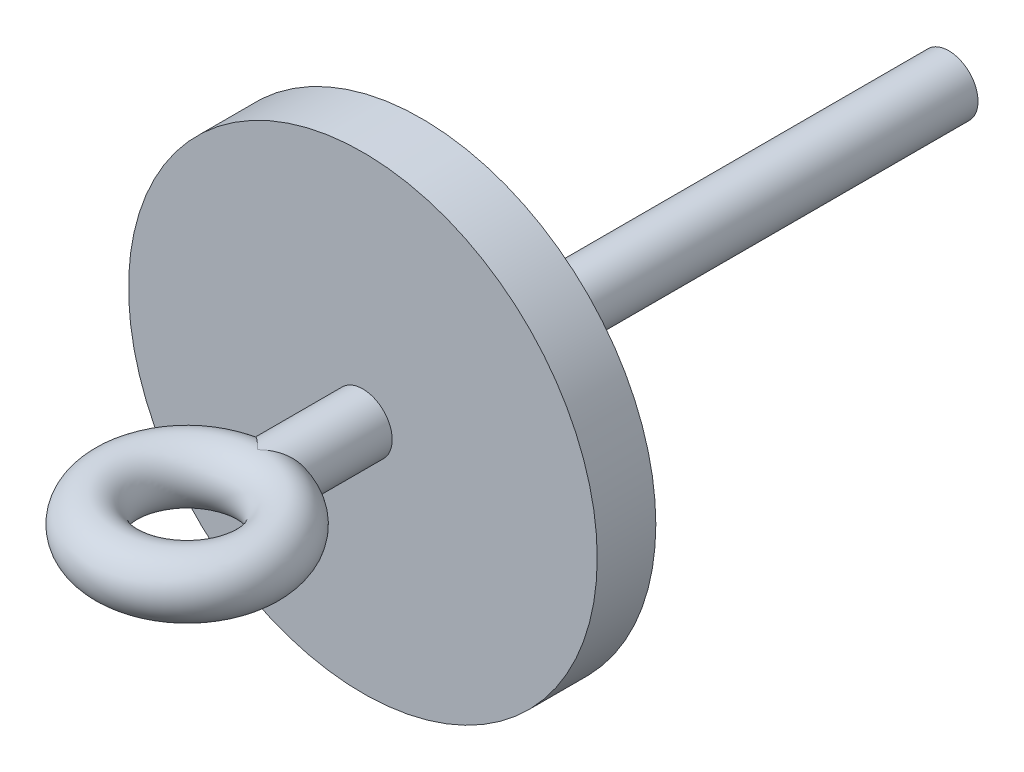
ISO-10303-21;
HEADER;
FILE_DESCRIPTION(('STEP AP214'),'2;1');
FILE_NAME('part.step','',(''),(''),'','','');
FILE_SCHEMA(('AUTOMOTIVE_DESIGN { 1 0 10303 214 1 1 1 1 }'));
ENDSEC;
DATA;
#1=APPLICATION_CONTEXT('core data for automotive mechanical design processes');
#2=APPLICATION_PROTOCOL_DEFINITION('international standard','automotive_design',2000,#1);
#3=PRODUCT_CONTEXT('',#1,'mechanical');
#4=PRODUCT('Part','Part','',(#3));
#5=PRODUCT_RELATED_PRODUCT_CATEGORY('part','',(#4));
#6=PRODUCT_DEFINITION_FORMATION('','',#4);
#7=PRODUCT_DEFINITION_CONTEXT('part definition',#1,'design');
#8=PRODUCT_DEFINITION('design','',#6,#7);
#9=PRODUCT_DEFINITION_SHAPE('','',#8);
#10=(LENGTH_UNIT() NAMED_UNIT(*) SI_UNIT(.MILLI.,.METRE.));
#11=(NAMED_UNIT(*) PLANE_ANGLE_UNIT() SI_UNIT($,.RADIAN.));
#12=(NAMED_UNIT(*) SI_UNIT($,.STERADIAN.) SOLID_ANGLE_UNIT());
#13=UNCERTAINTY_MEASURE_WITH_UNIT(LENGTH_MEASURE(1.E-05),#10,'distance_accuracy_value','');
#14=(GEOMETRIC_REPRESENTATION_CONTEXT(3) GLOBAL_UNCERTAINTY_ASSIGNED_CONTEXT((#13)) GLOBAL_UNIT_ASSIGNED_CONTEXT((#10,
#11,#12)) REPRESENTATION_CONTEXT('',''));
#15=CARTESIAN_POINT('',(0.,0.,0.));
#16=DIRECTION('',(0.,0.,1.));
#17=DIRECTION('',(1.,0.,0.));
#18=AXIS2_PLACEMENT_3D('',#15,#16,#17);
#19=CARTESIAN_POINT('',(0.,0.,35.56));
#20=DIRECTION('',(0.,0.,-1.));
#21=DIRECTION('',(-1.,0.,0.));
#22=AXIS2_PLACEMENT_3D('',#19,#20,#21);
#23=CYLINDRICAL_SURFACE('',#22,6.35);
#24=CARTESIAN_POINT('',(0.,-6.35000000000009,35.501253625829));
#25=CARTESIAN_POINT('',(-0.0037564512980739,-6.35000000036058,35.5050100734347));
#26=CARTESIAN_POINT('',(-0.00751223654004223,-6.34999666707801,35.508767242311));
#27=CARTESIAN_POINT('',(-0.271129257348103,-6.34952888217673,35.7725788813664));
#28=CARTESIAN_POINT('',(-0.527781565521979,-6.33312004361222,36.0360730521542));
#29=CARTESIAN_POINT('',(-1.03220959376142,-6.27070587561029,36.5683595895022));
#30=CARTESIAN_POINT('',(-1.27997450602316,-6.22466571976881,36.8371578292389));
#31=CARTESIAN_POINT('',(-1.76805434665272,-6.10414333444453,37.3825117283635));
#32=CARTESIAN_POINT('',(-2.00820748375621,-6.0292552810125,37.6591233476966));
#33=CARTESIAN_POINT('',(-2.35839961800037,-5.89711720426587,38.0756221022346));
#34=CARTESIAN_POINT('',(-2.47337437854273,-5.84981334488968,38.2146130487953));
#35=CARTESIAN_POINT('',(-2.69988551884257,-5.74878062329021,38.4930387674879));
#36=CARTESIAN_POINT('',(-2.81142221151381,-5.69505234796607,38.6324734979469));
#37=CARTESIAN_POINT('',(-2.92116985253,-5.63819711367648,38.7720672082961));
#38=B_SPLINE_CURVE_WITH_KNOTS('',3,(#24,#25,#26,#27,#28,#29,#30,#31,#32,#33,#34,#35,#36,#37),
.UNSPECIFIED.,.F.,.F.,(4,2,2,2,2,2,4),(0.,0.0159373808559223,1.11883785891247,2.22303697567802,
3.34337303091101,3.90269717381842,4.46197025894496),.UNSPECIFIED.);
#39=CARTESIAN_POINT('',(0.,-6.35,35.501253625829));
#40=VERTEX_POINT('',#39);
#41=CARTESIAN_POINT('',(-0.0586335826911054,-6.34972929367708,35.56));
#42=VERTEX_POINT('',#41);
#43=EDGE_CURVE('E77',#40,#42,#38,.T.);
#44=ORIENTED_EDGE('',*,*,#43,.F.);
#45=CARTESIAN_POINT('',(0.,-6.35000000000009,35.501253625829));
#46=CARTESIAN_POINT('',(0.0037564512980739,-6.35000000036058,35.5050100734347));
#47=CARTESIAN_POINT('',(0.00751223654004223,-6.34999666707801,35.508767242311));
#48=CARTESIAN_POINT('',(0.271129257348103,-6.34952888217673,35.7725788813664));
#49=CARTESIAN_POINT('',(0.527781565521979,-6.33312004361222,36.0360730521542));
#50=CARTESIAN_POINT('',(1.03220959376142,-6.27070587561029,36.5683595895022));
#51=CARTESIAN_POINT('',(1.27997450602316,-6.22466571976881,36.8371578292389));
#52=CARTESIAN_POINT('',(1.76805434665272,-6.10414333444453,37.3825117283635));
#53=CARTESIAN_POINT('',(2.00820748375621,-6.0292552810125,37.6591233476966));
#54=CARTESIAN_POINT('',(2.35839961800037,-5.89711720426587,38.0756221022346));
#55=CARTESIAN_POINT('',(2.47337437854273,-5.84981334488968,38.2146130487953));
#56=CARTESIAN_POINT('',(2.69988551884257,-5.74878062329021,38.4930387674879));
#57=CARTESIAN_POINT('',(2.81142221151381,-5.69505234796607,38.6324734979469));
#58=CARTESIAN_POINT('',(2.92116985253,-5.63819711367648,38.7720672082961));
#59=B_SPLINE_CURVE_WITH_KNOTS('',3,(#45,#46,#47,#48,#49,#50,#51,#52,#53,#54,#55,#56,#57,#58),
.UNSPECIFIED.,.F.,.F.,(4,2,2,2,2,2,4),(0.,0.0159373808559223,1.11883785891247,2.22303697567802,
3.34337303091101,3.90269717381842,4.46197025894496),.UNSPECIFIED.);
#60=CARTESIAN_POINT('',(0.0586335826906821,-6.34972929367708,35.56));
#61=VERTEX_POINT('',#60);
#62=EDGE_CURVE('E85',#61,#40,#59,.F.);
#63=ORIENTED_EDGE('',*,*,#62,.F.);
#64=CARTESIAN_POINT('',(0.,0.,35.56));
#65=DIRECTION('',(0.,0.,-1.));
#66=DIRECTION('',(-1.,0.,0.));
#67=AXIS2_PLACEMENT_3D('',#64,#65,#66);
#68=CIRCLE('',#67,6.35);
#69=EDGE_CURVE('E87',#61,#42,#68,.T.);
#70=ORIENTED_EDGE('',*,*,#69,.T.);
#71=EDGE_LOOP('',(#44,#63,#70));
#72=FACE_BOUND('',#71,.T.);
#73=ADVANCED_FACE('F34',(#72),#23,.T.);
#74=CARTESIAN_POINT('',(0.,6.35000000000009,35.501253625829));
#75=CARTESIAN_POINT('',(-0.00375639361291877,6.35000000520154,35.4974972215348));
#76=CARTESIAN_POINT('',(-0.00751356298510425,6.34999667190639,35.4937414358622));
#77=CARTESIAN_POINT('',(-0.390107309279998,6.34931703307963,35.1114303247573));
#78=CARTESIAN_POINT('',(-0.776767068298366,6.31467777937883,34.7392009537541));
#79=CARTESIAN_POINT('',(-1.3599412594465,6.2058328971805,34.1959170797559));
#80=CARTESIAN_POINT('',(-1.5551065347651,6.15997829409396,34.0171209188299));
#81=CARTESIAN_POINT('',(-1.94504898525613,6.04817108858059,33.6653536879688));
#82=CARTESIAN_POINT('',(-2.13982621408808,5.98222149186214,33.4923817511693));
#83=CARTESIAN_POINT('',(-2.4985011900884,5.84050488544785,33.1784104739015));
#84=CARTESIAN_POINT('',(-2.66271267322511,5.76762446414559,33.0364608093109));
#85=CARTESIAN_POINT('',(-2.98815377597978,5.60592855938799,32.7583544698739));
#86=CARTESIAN_POINT('',(-3.14938402460134,5.51711648062751,32.6221965649684));
#87=CARTESIAN_POINT('',(-3.4671726865702,5.32314077379262,32.3566803708456));
#88=CARTESIAN_POINT('',(-3.62373661829684,5.21799745430634,32.2273138999786));
#89=CARTESIAN_POINT('',(-3.93064752326748,4.99088496493317,31.9762024355633));
#90=CARTESIAN_POINT('',(-4.08099595734759,4.86891977826944,31.8544556476546));
#91=CARTESIAN_POINT('',(-4.34550443228042,4.63294828697975,31.642176622167));
#92=CARTESIAN_POINT('',(-4.46108235878655,4.52188801476302,31.5501305011624));
#93=CARTESIAN_POINT('',(-4.68573153522437,4.28866222868916,31.3724121616421));
#94=CARTESIAN_POINT('',(-4.79480418688662,4.16649912164926,31.2867385690092));
#95=CARTESIAN_POINT('',(-5.00526014226069,3.91117004389601,31.1224288672806));
#96=CARTESIAN_POINT('',(-5.10664036240707,3.77799970508135,31.0437955780907));
#97=CARTESIAN_POINT('',(-5.30029598327434,3.50112633498064,30.8943980935939));
#98=CARTESIAN_POINT('',(-5.39257555120921,3.35742817744298,30.8236302947541));
#99=CARTESIAN_POINT('',(-5.56754696086991,3.05862334535851,30.6900740282723));
#100=CARTESIAN_POINT('',(-5.65013865112166,2.90342069343537,30.6273683593042));
#101=CARTESIAN_POINT('',(-5.80324783550511,2.58383162487627,30.5115839228614));
#102=CARTESIAN_POINT('',(-5.87377192293083,2.41945028867314,30.4584998975292));
#103=CARTESIAN_POINT('',(-6.0014190404324,2.08275357144328,30.3627225183438));
#104=CARTESIAN_POINT('',(-6.05855021794399,1.91044309075926,30.3200228466837));
#105=CARTESIAN_POINT('',(-6.15826208039579,1.55935478160778,30.2456718234663));
#106=CARTESIAN_POINT('',(-6.20084576919992,1.38057829672605,30.2140181910189));
#107=CARTESIAN_POINT('',(-6.26523841865324,1.04584279074085,30.1662241647043));
#108=CARTESIAN_POINT('',(-6.28921686049892,0.890528261850745,30.14846041242));
#109=CARTESIAN_POINT('',(-6.32561388032198,0.577819579396626,30.1215148268776));
#110=CARTESIAN_POINT('',(-6.33803386354341,0.420425680996726,30.112331950381));
#111=CARTESIAN_POINT('',(-6.35109429752573,0.104956574372978,30.1026758873965));
#112=CARTESIAN_POINT('',(-6.35174007531249,-0.0531182933776525,30.1021987621491));
#113=CARTESIAN_POINT('',(-6.34125416587055,-0.368660313923154,30.1099508347809));
#114=CARTESIAN_POINT('',(-6.33012290220735,-0.52612748836951,30.1181797195453));
#115=CARTESIAN_POINT('',(-6.29773870122358,-0.825646545629134,30.1421496014706));
#116=CARTESIAN_POINT('',(-6.27743832295677,-0.967859740884441,30.1571838679943));
#117=CARTESIAN_POINT('',(-6.22745021484477,-1.24974316726769,30.1942642156613));
#118=CARTESIAN_POINT('',(-6.19775957077497,-1.38941259469895,30.216312473576));
#119=CARTESIAN_POINT('',(-6.12941514687342,-1.66521724938565,30.2671721018601));
#120=CARTESIAN_POINT('',(-6.09076482713282,-1.80135381846764,30.2959808614787));
#121=CARTESIAN_POINT('',(-6.00498571721766,-2.06941080556968,30.3600837925023));
#122=CARTESIAN_POINT('',(-5.95785370639359,-2.2013295995386,30.3953804275788));
#123=CARTESIAN_POINT('',(-5.85394359350793,-2.4646608432169,30.4734358359549));
#124=CARTESIAN_POINT('',(-5.79689050614631,-2.59590135702645,30.5164087001671));
#125=CARTESIAN_POINT('',(-5.67502757058692,-2.85250168055658,30.6085320310492));
#126=CARTESIAN_POINT('',(-5.6102149340774,-2.97785935368103,30.6576847186932));
#127=CARTESIAN_POINT('',(-5.4052292509548,-3.34427909330362,30.8137817328697));
#128=CARTESIAN_POINT('',(-5.25444328416657,-3.57585001659852,30.929413647487));
#129=CARTESIAN_POINT('',(-4.90991290770657,-4.03841874131397,31.1963613285227));
#130=CARTESIAN_POINT('',(-4.71314274171591,-4.26558204133736,31.3503467276975));
#131=CARTESIAN_POINT('',(-4.29872200940565,-4.68295380439284,31.6791010956807));
#132=CARTESIAN_POINT('',(-4.08105477197854,-4.87313238990884,31.8538866853871));
#133=CARTESIAN_POINT('',(-3.69032891616548,-5.17181733053833,32.1724717346972));
#134=CARTESIAN_POINT('',(-3.52044516507567,-5.28868752811816,32.3124607297584));
#135=CARTESIAN_POINT('',(-3.17517117605227,-5.50291670054365,32.6004201763046));
#136=CARTESIAN_POINT('',(-2.99977873715972,-5.60026775893275,32.748393835408));
#137=CARTESIAN_POINT('',(-2.46804040076927,-5.86411467374307,33.2028719306896));
#138=CARTESIAN_POINT('',(-2.10625559426743,-6.00231400935948,33.5198346776668));
#139=CARTESIAN_POINT('',(-1.45261018380176,-6.18906686582442,34.1096606501983));
#140=CARTESIAN_POINT('',(-1.16087377709956,-6.24984757095819,34.3790679257008));
#141=CARTESIAN_POINT('',(-0.58179700658449,-6.33002123891588,34.9277551390341));
#142=CARTESIAN_POINT('',(-0.294449784109341,-6.3494871653946,35.2070167851061));
#143=CARTESIAN_POINT('',(-0.00751359891461443,-6.3499966691027,35.493741405258));
#144=CARTESIAN_POINT('',(-0.00375642976168776,-6.35000000240225,35.4974971907567));
#145=CARTESIAN_POINT('',(0.,-6.35000000000009,35.501253625829));
#146=B_SPLINE_CURVE_WITH_KNOTS('',3,(#74,#75,#76,#77,#78,#79,#80,#81,#82,#83,#84,#85,#86,#87,
#88,#89,#90,#91,#92,#93,#94,#95,#96,#97,#98,#99,#100,#101,#102,#103,#104,#105,#106,#107,#108,
#109,#110,#111,#112,#113,#114,#115,#116,#117,#118,#119,#120,#121,#122,#123,#124,#125,#126,#127,
#128,#129,#130,#131,#132,#133,#134,#135,#136,#137,#138,#139,#140,#141,#142,#143,#144,#145),
.UNSPECIFIED.,.F.,.F.,(4,2,2,2,2,2,2,2,2,2,2,2,2,2,2,2,2,2,2,2,2,2,2,2,2,2,2,2,2,2,2,2,2,2,2,4),
(0.,0.0159373808601486,1.62257605524638,2.42788792124242,3.23307939180828,3.91940326281971,
4.60558063648164,5.29091145206725,5.9760802669741,6.53008486902063,7.08396966185482,
7.63807532303239,8.19192606799116,8.75107450688236,9.30991646537213,9.86841757086282,
10.4268032834616,10.9006289197143,11.3743969420844,11.847950611377,12.3214872497212,
12.7543088532636,13.1872649129708,13.6200540493278,14.0530078715458,14.5007833109723,
14.948720139442,15.8440552615959,16.8534998557398,17.863756556851,18.6104826085817,
19.3575109031355,20.8521042157741,22.0551983034912,23.2561659018778,23.2721032827379),.UNSPECIFIED.);
#147=CARTESIAN_POINT('',(0.,6.35,35.501253625829));
#148=VERTEX_POINT('',#147);
#149=EDGE_CURVE('E74',#148,#40,#146,.T.);
#150=ORIENTED_EDGE('',*,*,#149,.F.);
#151=CARTESIAN_POINT('',(0.,-6.35000000000009,35.501253625829));
#152=CARTESIAN_POINT('',(0.00375639361291877,-6.35000000520154,35.4974972215348));
#153=CARTESIAN_POINT('',(0.00751356298510425,-6.34999667190639,35.4937414358622));
#154=CARTESIAN_POINT('',(0.390107309279998,-6.34931703307963,35.1114303247573));
#155=CARTESIAN_POINT('',(0.776767068298366,-6.31467777937883,34.7392009537541));
#156=CARTESIAN_POINT('',(1.3599412594465,-6.2058328971805,34.1959170797559));
#157=CARTESIAN_POINT('',(1.5551065347651,-6.15997829409396,34.0171209188299));
#158=CARTESIAN_POINT('',(1.94504898525613,-6.04817108858059,33.6653536879688));
#159=CARTESIAN_POINT('',(2.13982621408808,-5.98222149186214,33.4923817511693));
#160=CARTESIAN_POINT('',(2.4985011900884,-5.84050488544785,33.1784104739015));
#161=CARTESIAN_POINT('',(2.66271267322511,-5.76762446414559,33.0364608093109));
#162=CARTESIAN_POINT('',(2.98815377597978,-5.60592855938799,32.7583544698739));
#163=CARTESIAN_POINT('',(3.14938402460134,-5.51711648062751,32.6221965649684));
#164=CARTESIAN_POINT('',(3.4671726865702,-5.32314077379262,32.3566803708456));
#165=CARTESIAN_POINT('',(3.62373661829684,-5.21799745430634,32.2273138999786));
#166=CARTESIAN_POINT('',(3.93064752326748,-4.99088496493317,31.9762024355633));
#167=CARTESIAN_POINT('',(4.08099595734759,-4.86891977826944,31.8544556476546));
#168=CARTESIAN_POINT('',(4.34550443228042,-4.63294828697975,31.642176622167));
#169=CARTESIAN_POINT('',(4.46108235878655,-4.52188801476302,31.5501305011624));
#170=CARTESIAN_POINT('',(4.68573153522437,-4.28866222868916,31.3724121616421));
#171=CARTESIAN_POINT('',(4.79480418688662,-4.16649912164926,31.2867385690092));
#172=CARTESIAN_POINT('',(5.00526014226069,-3.91117004389601,31.1224288672806));
#173=CARTESIAN_POINT('',(5.10664036240707,-3.77799970508135,31.0437955780907));
#174=CARTESIAN_POINT('',(5.30029598327434,-3.50112633498064,30.8943980935939));
#175=CARTESIAN_POINT('',(5.39257555120921,-3.35742817744298,30.8236302947541));
#176=CARTESIAN_POINT('',(5.56754696086991,-3.05862334535851,30.6900740282723));
#177=CARTESIAN_POINT('',(5.65013865112166,-2.90342069343537,30.6273683593042));
#178=CARTESIAN_POINT('',(5.80324783550511,-2.58383162487627,30.5115839228614));
#179=CARTESIAN_POINT('',(5.87377192293083,-2.41945028867314,30.4584998975292));
#180=CARTESIAN_POINT('',(6.0014190404324,-2.08275357144328,30.3627225183438));
#181=CARTESIAN_POINT('',(6.05855021794399,-1.91044309075926,30.3200228466837));
#182=CARTESIAN_POINT('',(6.15826208039579,-1.55935478160778,30.2456718234663));
#183=CARTESIAN_POINT('',(6.20084576919992,-1.38057829672605,30.2140181910189));
#184=CARTESIAN_POINT('',(6.26523841865324,-1.04584279074085,30.1662241647043));
#185=CARTESIAN_POINT('',(6.28921686049892,-0.890528261850745,30.14846041242));
#186=CARTESIAN_POINT('',(6.32561388032198,-0.577819579396626,30.1215148268776));
#187=CARTESIAN_POINT('',(6.33803386354341,-0.420425680996726,30.112331950381));
#188=CARTESIAN_POINT('',(6.35109429752573,-0.104956574372978,30.1026758873965));
#189=CARTESIAN_POINT('',(6.35174007531249,0.0531182933776525,30.1021987621491));
#190=CARTESIAN_POINT('',(6.34125416587055,0.368660313923154,30.1099508347809));
#191=CARTESIAN_POINT('',(6.33012290220735,0.52612748836951,30.1181797195453));
#192=CARTESIAN_POINT('',(6.29773870122358,0.825646545629134,30.1421496014706));
#193=CARTESIAN_POINT('',(6.27743832295677,0.967859740884441,30.1571838679943));
#194=CARTESIAN_POINT('',(6.22745021484477,1.24974316726769,30.1942642156613));
#195=CARTESIAN_POINT('',(6.19775957077497,1.38941259469895,30.216312473576));
#196=CARTESIAN_POINT('',(6.12941514687342,1.66521724938565,30.2671721018601));
#197=CARTESIAN_POINT('',(6.09076482713282,1.80135381846764,30.2959808614787));
#198=CARTESIAN_POINT('',(6.00498571721766,2.06941080556968,30.3600837925023));
#199=CARTESIAN_POINT('',(5.95785370639359,2.2013295995386,30.3953804275788));
#200=CARTESIAN_POINT('',(5.85394359350793,2.4646608432169,30.4734358359549));
#201=CARTESIAN_POINT('',(5.79689050614631,2.59590135702645,30.5164087001671));
#202=CARTESIAN_POINT('',(5.67502757058692,2.85250168055658,30.6085320310492));
#203=CARTESIAN_POINT('',(5.6102149340774,2.97785935368103,30.6576847186932));
#204=CARTESIAN_POINT('',(5.4052292509548,3.34427909330362,30.8137817328697));
#205=CARTESIAN_POINT('',(5.25444328416657,3.57585001659852,30.929413647487));
#206=CARTESIAN_POINT('',(4.90991290770657,4.03841874131397,31.1963613285227));
#207=CARTESIAN_POINT('',(4.71314274171591,4.26558204133736,31.3503467276975));
#208=CARTESIAN_POINT('',(4.29872200940565,4.68295380439284,31.6791010956807));
#209=CARTESIAN_POINT('',(4.08105477197854,4.87313238990884,31.8538866853871));
#210=CARTESIAN_POINT('',(3.69032891616548,5.17181733053833,32.1724717346972));
#211=CARTESIAN_POINT('',(3.52044516507567,5.28868752811816,32.3124607297584));
#212=CARTESIAN_POINT('',(3.17517117605227,5.50291670054365,32.6004201763046));
#213=CARTESIAN_POINT('',(2.99977873715972,5.60026775893275,32.748393835408));
#214=CARTESIAN_POINT('',(2.46804040076927,5.86411467374307,33.2028719306896));
#215=CARTESIAN_POINT('',(2.10625559426743,6.00231400935948,33.5198346776668));
#216=CARTESIAN_POINT('',(1.45261018380176,6.18906686582442,34.1096606501983));
#217=CARTESIAN_POINT('',(1.16087377709956,6.24984757095819,34.3790679257008));
#218=CARTESIAN_POINT('',(0.58179700658449,6.33002123891588,34.9277551390341));
#219=CARTESIAN_POINT('',(0.294449784109341,6.3494871653946,35.2070167851061));
#220=CARTESIAN_POINT('',(0.00751359891461443,6.3499966691027,35.493741405258));
#221=CARTESIAN_POINT('',(0.00375642976168776,6.35000000240225,35.4974971907567));
#222=CARTESIAN_POINT('',(0.,6.35000000000009,35.501253625829));
#223=B_SPLINE_CURVE_WITH_KNOTS('',3,(#151,#152,#153,#154,#155,#156,#157,#158,#159,#160,#161,
#162,#163,#164,#165,#166,#167,#168,#169,#170,#171,#172,#173,#174,#175,#176,#177,#178,#179,#180,
#181,#182,#183,#184,#185,#186,#187,#188,#189,#190,#191,#192,#193,#194,#195,#196,#197,#198,#199,
#200,#201,#202,#203,#204,#205,#206,#207,#208,#209,#210,#211,#212,#213,#214,#215,#216,#217,#218,
#219,#220,#221,#222),.UNSPECIFIED.,.F.,.F.,(4,2,2,2,2,2,2,2,2,2,2,2,2,2,2,2,2,2,2,2,2,2,2,2,2,2,
2,2,2,2,2,2,2,2,2,4),(0.,0.0159373808601486,1.62257605524638,2.42788792124242,3.23307939180828,
3.91940326281971,4.60558063648164,5.29091145206725,5.9760802669741,6.53008486902063,
7.08396966185482,7.63807532303239,8.19192606799116,8.75107450688236,9.30991646537213,
9.86841757086282,10.4268032834616,10.9006289197143,11.3743969420844,11.847950611377,
12.3214872497212,12.7543088532636,13.1872649129708,13.6200540493278,14.0530078715458,
14.5007833109723,14.948720139442,15.8440552615959,16.8534998557398,17.863756556851,
18.6104826085817,19.3575109031355,20.8521042157741,22.0551983034912,23.2561659018778,
23.2721032827379),.UNSPECIFIED.);
#224=EDGE_CURVE('E89',#40,#148,#223,.T.);
#225=ORIENTED_EDGE('',*,*,#224,.F.);
#226=EDGE_LOOP('',(#150,#225));
#227=FACE_BOUND('',#226,.T.);
#228=CARTESIAN_POINT('',(0.,0.,12.7));
#229=DIRECTION('',(0.,0.,1.));
#230=DIRECTION('',(1.,0.,0.));
#231=AXIS2_PLACEMENT_3D('',#228,#229,#230);
#232=CIRCLE('',#231,6.35);
#233=CARTESIAN_POINT('',(6.35,0.,12.7));
#234=VERTEX_POINT('',#233);
#235=EDGE_CURVE('E162',#234,#234,#232,.T.);
#236=ORIENTED_EDGE('',*,*,#235,.T.);
#237=EDGE_LOOP('',(#236));
#238=FACE_BOUND('',#237,.T.);
#239=ADVANCED_FACE('F91',(#227,#238),#23,.T.);
#240=CARTESIAN_POINT('',(0.,0.,35.56));
#241=DIRECTION('',(0.,0.,-1.));
#242=DIRECTION('',(-1.,0.,0.));
#243=AXIS2_PLACEMENT_3D('',#240,#241,#242);
#244=PLANE('',#243);
#245=CARTESIAN_POINT('',(-14.1992316571237,3.11948990475159,35.56));
#246=CARTESIAN_POINT('',(-14.0681365765391,3.27793501526219,35.56));
#247=CARTESIAN_POINT('',(-13.9286455019853,3.42942764303941,35.56));
#248=CARTESIAN_POINT('',(-13.6355341905472,3.71818828946817,35.56));
#249=CARTESIAN_POINT('',(-13.4819034529782,3.85544557284839,35.56));
#250=CARTESIAN_POINT('',(-13.1626777704734,4.11603913724592,35.56));
#251=CARTESIAN_POINT('',(-12.9970542351758,4.23934022718965,35.56));
#252=CARTESIAN_POINT('',(-12.6563219360084,4.47209705397215,35.56));
#253=CARTESIAN_POINT('',(-12.4812095636351,4.58154747001896,35.56));
#254=CARTESIAN_POINT('',(-12.0545007276696,4.82683875196605,35.56));
#255=CARTESIAN_POINT('',(-11.7994147076043,4.95661587218982,35.56));
#256=CARTESIAN_POINT('',(-11.2787063161964,5.19303594985384,35.56));
#257=CARTESIAN_POINT('',(-11.0130774930413,5.29966447472431,35.56));
#258=CARTESIAN_POINT('',(-10.4740292516195,5.49235423967037,35.56));
#259=CARTESIAN_POINT('',(-10.2005974272737,5.57838042063449,35.56));
#260=CARTESIAN_POINT('',(-9.64891231492096,5.73212058653271,35.56));
#261=CARTESIAN_POINT('',(-9.37066239072188,5.79984683949048,35.56));
#262=CARTESIAN_POINT('',(-8.61433001901108,5.96163800273751,35.56));
#263=CARTESIAN_POINT('',(-8.13307651465053,6.04082095359623,35.56));
#264=CARTESIAN_POINT('',(-7.16610664219062,6.16545253739759,35.56));
#265=CARTESIAN_POINT('',(-6.68038629701272,6.21086740071027,35.56));
#266=CARTESIAN_POINT('',(-5.70556590755282,6.2785764172918,35.56));
#267=CARTESIAN_POINT('',(-5.21646006431048,6.30078005613277,35.56));
#268=CARTESIAN_POINT('',(-4.48262879047559,6.32339990075735,35.56));
#269=CARTESIAN_POINT('',(-4.23802760858134,6.32915884822764,35.56));
#270=CARTESIAN_POINT('',(-3.74877673268384,6.3380857686028,35.56));
#271=CARTESIAN_POINT('',(-3.50412703896901,6.34125375647569,35.56));
#272=CARTESIAN_POINT('',(-3.0133066172643,6.34588009063594,35.56));
#273=CARTESIAN_POINT('',(-2.76713581005504,6.34732777716004,35.56));
#274=CARTESIAN_POINT('',(-2.27479089459125,6.34920586109839,35.56));
#275=CARTESIAN_POINT('',(-2.02861678633845,6.34963625902804,35.56));
#276=CARTESIAN_POINT('',(-1.536259901933,6.35004292727922,35.56));
#277=CARTESIAN_POINT('',(-1.2900771257811,6.35001918157072,35.56));
#278=CARTESIAN_POINT('',(-0.797711920403267,6.349897247307,35.56));
#279=CARTESIAN_POINT('',(-0.551529491177317,6.34979905885373,35.56));
#280=CARTESIAN_POINT('',(-0.0596328747198961,6.34971264937751,35.56));
#281=CARTESIAN_POINT('',(0.186081312465314,6.34972421953955,35.56));
#282=CARTESIAN_POINT('',(0.677510010683249,6.34983955634036,35.56));
#283=CARTESIAN_POINT('',(0.923224521715926,6.34994332311297,35.56));
#284=CARTESIAN_POINT('',(1.41465088517471,6.3500258890747,35.56));
#285=CARTESIAN_POINT('',(1.66036273760024,6.35000468964254,35.56));
#286=CARTESIAN_POINT('',(2.15178562076105,6.34942859705037,35.56));
#287=CARTESIAN_POINT('',(2.39749665149687,6.34887370520193,35.56));
#288=CARTESIAN_POINT('',(2.85134526337037,6.34681059832293,35.56));
#289=CARTESIAN_POINT('',(3.05948345092324,6.34546112011608,35.56));
#290=CARTESIAN_POINT('',(3.47574789106985,6.34150431291261,35.56));
#291=CARTESIAN_POINT('',(3.68387414370224,6.33889698824936,35.56));
#292=CARTESIAN_POINT('',(4.10018068788496,6.33189957597568,35.56));
#293=CARTESIAN_POINT('',(4.30836096868586,6.32750879072042,35.56));
#294=CARTESIAN_POINT('',(4.72466055811453,6.31634779689845,35.56));
#295=CARTESIAN_POINT('',(4.93277986556879,6.30957754520618,35.56));
#296=CARTESIAN_POINT('',(5.55644682046397,6.28475228305205,35.56));
#297=CARTESIAN_POINT('',(5.9718379472561,6.26217702174318,35.56));
#298=CARTESIAN_POINT('',(6.80125984287806,6.19912769623004,35.56));
#299=CARTESIAN_POINT('',(7.21529092086682,6.15865803105502,35.56));
#300=CARTESIAN_POINT('',(7.96950242551946,6.0622591140621,35.56));
#301=CARTESIAN_POINT('',(8.31016110947234,6.01017559076111,35.56));
#302=CARTESIAN_POINT('',(8.98758988539727,5.88512534667819,35.56));
#303=CARTESIAN_POINT('',(9.32436136126035,5.81216631234497,35.56));
#304=CARTESIAN_POINT('',(9.99101495422766,5.64118476020339,35.56));
#305=CARTESIAN_POINT('',(10.3209076813324,5.54320449511565,35.56));
#306=CARTESIAN_POINT('',(10.9703327361502,5.31780365178138,35.56));
#307=CARTESIAN_POINT('',(11.2898733111694,5.19040720089277,35.56));
#308=CARTESIAN_POINT('',(11.9473782852239,4.88615882438984,35.56));
#309=CARTESIAN_POINT('',(12.2835966031719,4.70544788123638,35.56));
#310=CARTESIAN_POINT('',(12.9267404678049,4.29758176356681,35.56));
#311=CARTESIAN_POINT('',(13.2336928429774,4.07046973779006,35.56));
#312=CARTESIAN_POINT('',(13.7596634891047,3.60668493048318,35.56));
#313=CARTESIAN_POINT('',(13.9849123758527,3.37719428819024,35.56));
#314=CARTESIAN_POINT('',(14.292159033369,3.00779483056579,35.56));
#315=CARTESIAN_POINT('',(14.3894700981202,2.88046783453529,35.56));
#316=CARTESIAN_POINT('',(14.5726204892649,2.61777495541423,35.56));
#317=CARTESIAN_POINT('',(14.6584616506589,2.48241036322723,35.56));
#318=CARTESIAN_POINT('',(14.8047249224587,2.22634305053424,35.56));
#319=CARTESIAN_POINT('',(14.8670200509174,2.10670713972802,35.56));
#320=CARTESIAN_POINT('',(14.9817268378026,1.86279377964067,35.56));
#321=CARTESIAN_POINT('',(15.0341402170428,1.7385171430226,35.56));
#322=CARTESIAN_POINT('',(15.1283746046489,1.48600774529588,35.56));
#323=CARTESIAN_POINT('',(15.1701960446292,1.35777514562904,35.56));
#324=CARTESIAN_POINT('',(15.2426210377553,1.09823522989298,35.56));
#325=CARTESIAN_POINT('',(15.2732297547006,0.966929358874774,35.56));
#326=CARTESIAN_POINT('',(15.3228785570752,0.701610209112566,35.56));
#327=CARTESIAN_POINT('',(15.3418729301043,0.567588350241689,35.56));
#328=CARTESIAN_POINT('',(15.3677911906661,0.298430946812191,35.56));
#329=CARTESIAN_POINT('',(15.3747196758894,0.163295846183207,35.56));
#330=CARTESIAN_POINT('',(15.3764055549231,-0.107076590364631,35.56));
#331=CARTESIAN_POINT('',(15.3711605923371,-0.242313941010478,35.56));
#332=CARTESIAN_POINT('',(15.3485827558504,-0.511768391614949,35.56));
#333=CARTESIAN_POINT('',(15.3312503177348,-0.645985528178618,35.56));
#334=CARTESIAN_POINT('',(15.2861348314259,-0.904576711162734,35.56));
#335=CARTESIAN_POINT('',(15.2590210283205,-1.02906792439823,35.56));
#336=CARTESIAN_POINT('',(15.1947114608199,-1.27543096431832,35.56));
#337=CARTESIAN_POINT('',(15.1575124097558,-1.39730192309285,35.56));
#338=CARTESIAN_POINT('',(15.0315243628892,-1.75772033086818,35.56));
#339=CARTESIAN_POINT('',(14.9282929611342,-1.99136072757108,35.56));
#340=CARTESIAN_POINT('',(14.6817348775632,-2.45284456509874,35.56));
#341=CARTESIAN_POINT('',(14.5365124284656,-2.67965933714536,35.56));
#342=CARTESIAN_POINT('',(14.2150160759445,-3.1103521877165,35.56));
#343=CARTESIAN_POINT('',(14.0387043416035,-3.31420182015407,35.56));
#344=CARTESIAN_POINT('',(13.7091031974153,-3.64900005377224,35.56));
#345=CARTESIAN_POINT('',(13.5612251921028,-3.78536694834291,35.56));
#346=CARTESIAN_POINT('',(13.2539869999851,-4.04453365789856,35.56));
#347=CARTESIAN_POINT('',(13.094622315919,-4.16732811081213,35.56));
#348=CARTESIAN_POINT('',(12.6027045315485,-4.51559869935438,35.56));
#349=CARTESIAN_POINT('',(12.255991049155,-4.72129280379332,35.56));
#350=CARTESIAN_POINT('',(11.6215329757349,-5.04267447539571,35.56));
#351=CARTESIAN_POINT('',(11.3385553356007,-5.16818284630639,35.56));
#352=CARTESIAN_POINT('',(10.7625008759813,-5.39395590417219,35.56));
#353=CARTESIAN_POINT('',(10.4694169236622,-5.49420232930825,35.56));
#354=CARTESIAN_POINT('',(9.87469780713725,-5.67307973296213,35.56));
#355=CARTESIAN_POINT('',(9.57301861869352,-5.75156194482212,35.56));
#356=CARTESIAN_POINT('',(9.11744376807968,-5.85482026320685,35.56));
#357=CARTESIAN_POINT('',(8.96513216395802,-5.88681984599821,35.56));
#358=CARTESIAN_POINT('',(8.65966627214624,-5.94640791791189,35.56));
#359=CARTESIAN_POINT('',(8.50651208825863,-5.97399693834432,35.56));
#360=CARTESIAN_POINT('',(8.01650283372625,-6.05566228859114,35.56));
#361=CARTESIAN_POINT('',(7.67836440900315,-6.10209460784584,35.56));
#362=CARTESIAN_POINT('',(7.00029540399178,-6.17954007938873,35.56));
#363=CARTESIAN_POINT('',(6.66036424846703,-6.21054793438186,35.56));
#364=CARTESIAN_POINT('',(5.97917145308324,-6.26075370642175,35.56));
#365=CARTESIAN_POINT('',(5.63790860224862,-6.279934554235,35.56));
#366=CARTESIAN_POINT('',(4.95507053824761,-6.30968358230823,35.56));
#367=CARTESIAN_POINT('',(4.61349536045404,-6.3202526399901,35.56));
#368=CARTESIAN_POINT('',(3.92823291943829,-6.33570506004879,35.56));
#369=CARTESIAN_POINT('',(3.58454498199439,-6.3405548243333,35.56));
#370=CARTESIAN_POINT('',(2.89713918209377,-6.34691267757191,35.56));
#371=CARTESIAN_POINT('',(2.55342131920838,-6.34842070611045,35.56));
#372=CARTESIAN_POINT('',(1.86630550331536,-6.34998417284897,35.56));
#373=CARTESIAN_POINT('',(1.52290755144878,-6.35004096686907,35.56));
#374=CARTESIAN_POINT('',(0.836116638732788,-6.34993171881042,35.56));
#375=CARTESIAN_POINT('',(0.49272367788077,-6.34976567984947,35.56));
#376=CARTESIAN_POINT('',(-0.193945977919706,-6.34970428575641,35.56));
#377=CARTESIAN_POINT('',(-0.537222672847685,-6.34980883894764,35.56));
#378=CARTESIAN_POINT('',(-1.22378025881177,-6.3500161980581,35.56));
#379=CARTESIAN_POINT('',(-1.56706114984756,-6.35011900395584,35.56));
#380=CARTESIAN_POINT('',(-2.25392224432474,-6.3493038645532,35.56));
#381=CARTESIAN_POINT('',(-2.59750244779217,-6.34838502925332,35.56));
#382=CARTESIAN_POINT('',(-3.28464483830874,-6.34381987345198,35.56));
#383=CARTESIAN_POINT('',(-3.62820702555454,-6.34017359520824,35.56));
#384=CARTESIAN_POINT('',(-4.3133941054692,-6.32788819524128,35.56));
#385=CARTESIAN_POINT('',(-4.65501942120197,-6.31927619798559,35.56));
#386=CARTESIAN_POINT('',(-5.33804395056882,-6.29432776422818,35.56));
#387=CARTESIAN_POINT('',(-5.6794431402959,-6.27799061143434,35.56));
#388=CARTESIAN_POINT('',(-6.36113608932264,-6.2344587074531,35.56));
#389=CARTESIAN_POINT('',(-6.70143070564692,-6.20727794834739,35.56));
#390=CARTESIAN_POINT('',(-7.38054193979489,-6.1385659928401,35.56));
#391=CARTESIAN_POINT('',(-7.71935898259281,-6.09703924198316,35.56));
#392=CARTESIAN_POINT('',(-8.19108681236241,-6.02630346467132,35.56));
#393=CARTESIAN_POINT('',(-8.32515442968354,-6.00473050947013,35.56));
#394=CARTESIAN_POINT('',(-8.59276201903617,-5.95845332383353,35.56));
#395=CARTESIAN_POINT('',(-8.72630193352814,-5.93374876114761,35.56));
#396=CARTESIAN_POINT('',(-9.12609699193533,-5.8545215695578,35.56));
#397=CARTESIAN_POINT('',(-9.3913742065954,-5.79490778771573,35.56));
#398=CARTESIAN_POINT('',(-9.91695987857941,-5.66024829620943,35.56));
#399=CARTESIAN_POINT('',(-10.177283198435,-5.58526108246903,35.56));
#400=CARTESIAN_POINT('',(-10.6921477279515,-5.41758449761112,35.56));
#401=CARTESIAN_POINT('',(-10.946691006124,-5.32490157466575,35.56));
#402=CARTESIAN_POINT('',(-11.3935927308221,-5.14186186455221,35.56));
#403=CARTESIAN_POINT('',(-11.5875127217455,-5.0553224310869,35.56));
#404=CARTESIAN_POINT('',(-11.9690144579775,-4.8690430676856,35.56));
#405=CARTESIAN_POINT('',(-12.1565945697904,-4.76929976778016,35.56));
#406=CARTESIAN_POINT('',(-12.5235090325964,-4.55582030892259,35.56));
#407=CARTESIAN_POINT('',(-12.7028482908971,-4.44209262977394,35.56));
#408=CARTESIAN_POINT('',(-13.0512321769964,-4.19995705247871,35.56));
#409=CARTESIAN_POINT('',(-13.2202832339367,-4.07155846965764,35.56));
#410=CARTESIAN_POINT('',(-13.530934527276,-3.81200659696609,35.56));
#411=CARTESIAN_POINT('',(-13.6736324820536,-3.68217034459285,35.56));
#412=CARTESIAN_POINT('',(-13.9464095192917,-3.41007134132159,35.56));
#413=CARTESIAN_POINT('',(-14.0765029402691,-3.2678230686867,35.56));
#414=CARTESIAN_POINT('',(-14.2996810831094,-2.99808407933595,35.56));
#415=CARTESIAN_POINT('',(-14.395196978394,-2.87260205512921,35.56));
#416=CARTESIAN_POINT('',(-14.5751854410804,-2.61373156633779,35.56));
#417=CARTESIAN_POINT('',(-14.6596474430998,-2.48033571206798,35.56));
#418=CARTESIAN_POINT('',(-14.8046938613989,-2.22639627705346,35.56));
#419=CARTESIAN_POINT('',(-14.8669641796273,-2.10681407213147,35.56));
#420=CARTESIAN_POINT('',(-14.981630016714,-1.86301151183334,35.56));
#421=CARTESIAN_POINT('',(-15.0340271330463,-1.73879191068669,35.56));
#422=CARTESIAN_POINT('',(-15.1282802955989,-1.48628864814347,35.56));
#423=CARTESIAN_POINT('',(-15.1701275198121,-1.3580016857873,35.56));
#424=CARTESIAN_POINT('',(-15.2425942205796,-1.09835031864442,35.56));
#425=CARTESIAN_POINT('',(-15.2732188949406,-0.966987368593972,35.56));
#426=CARTESIAN_POINT('',(-15.3228801181558,-0.70160189086189,35.56));
#427=CARTESIAN_POINT('',(-15.3418753311484,-0.567571604705999,35.56));
#428=CARTESIAN_POINT('',(-15.3677936528154,-0.298397190616121,35.56));
#429=CARTESIAN_POINT('',(-15.3747213644951,-0.163253507146281,35.56));
#430=CARTESIAN_POINT('',(-15.3764043981846,0.107119652337502,35.56));
#431=CARTESIAN_POINT('',(-15.3711587906501,0.242349134114668,35.56));
#432=CARTESIAN_POINT('',(-15.34857999927,0.51178759653163,35.56));
#433=CARTESIAN_POINT('',(-15.3312474283129,0.645996628566145,35.56));
#434=CARTESIAN_POINT('',(-15.2861329515632,0.904592629408424,35.56));
#435=CARTESIAN_POINT('',(-15.2590177476052,1.02909671805847,35.56));
#436=CARTESIAN_POINT('',(-15.1946864411176,1.27551056921208,35.56));
#437=CARTESIAN_POINT('',(-15.1574666828515,1.39741937551793,35.56));
#438=CARTESIAN_POINT('',(-15.073457368893,1.63777449669492,35.56));
#439=CARTESIAN_POINT('',(-15.0266757552562,1.75622359247439,35.56));
#440=CARTESIAN_POINT('',(-14.9241023745083,1.98916293914365,35.56));
#441=CARTESIAN_POINT('',(-14.8683087143458,2.10365235212266,35.56));
#442=CARTESIAN_POINT('',(-14.7225815717109,2.37636469103874,35.56));
#443=CARTESIAN_POINT('',(-14.6282732334099,2.53226741182707,35.56));
#444=CARTESIAN_POINT('',(-14.4245748704982,2.83375525496028,35.56));
#445=CARTESIAN_POINT('',(-14.3151876621306,2.97934229626956,35.56));
#446=CARTESIAN_POINT('',(-14.1992316571237,3.11948990475159,35.56));
#447=B_SPLINE_CURVE_WITH_KNOTS('',3,(#245,#246,#247,#248,#249,#250,#251,#252,#253,#254,#255,
#256,#257,#258,#259,#260,#261,#262,#263,#264,#265,#266,#267,#268,#269,#270,#271,#272,#273,#274,
#275,#276,#277,#278,#279,#280,#281,#282,#283,#284,#285,#286,#287,#288,#289,#290,#291,#292,#293,
#294,#295,#296,#297,#298,#299,#300,#301,#302,#303,#304,#305,#306,#307,#308,#309,#310,#311,#312,
#313,#314,#315,#316,#317,#318,#319,#320,#321,#322,#323,#324,#325,#326,#327,#328,#329,#330,#331,
#332,#333,#334,#335,#336,#337,#338,#339,#340,#341,#342,#343,#344,#345,#346,#347,#348,#349,#350,
#351,#352,#353,#354,#355,#356,#357,#358,#359,#360,#361,#362,#363,#364,#365,#366,#367,#368,#369,
#370,#371,#372,#373,#374,#375,#376,#377,#378,#379,#380,#381,#382,#383,#384,#385,#386,#387,#388,
#389,#390,#391,#392,#393,#394,#395,#396,#397,#398,#399,#400,#401,#402,#403,#404,#405,#406,#407,
#408,#409,#410,#411,#412,#413,#414,#415,#416,#417,#418,#419,#420,#421,#422,#423,#424,#425,#426,
#427,#428,#429,#430,#431,#432,#433,#434,#435,#436,#437,#438,#439,#440,#441,#442,#443,#444,#445,
#446),.UNSPECIFIED.,.T.,.F.,(4,2,2,2,2,2,2,2,2,2,2,2,2,2,2,2,2,2,2,2,2,2,2,2,2,2,2,2,2,2,2,2,2,
2,2,2,2,2,2,2,2,2,2,2,2,2,2,2,2,2,2,2,2,2,2,2,2,2,2,2,2,2,2,2,2,2,2,2,2,2,2,2,2,2,2,2,2,2,2,2,2,
2,2,2,2,2,2,2,2,2,2,2,2,2,2,2,2,2,2,2,4),(0.,0.616698749270546,1.23385923741018,
1.85254279318281,2.47146330186461,3.3286765561024,4.18642273615949,5.04561833751464,
5.90423650862114,7.36555378339268,8.82833048389536,10.2967903842442,11.0307924231776,
11.7647902217391,12.5033128717897,13.2418351476714,13.9803834914303,14.7189308239349,
15.4560733574095,16.1932169609267,16.9303524318557,17.6674860912637,18.2919112133377,
18.916334184237,19.5410016492588,20.1656804363632,21.4134350547796,22.660883104726,
23.6942192984767,24.7271755021521,25.7583987822124,26.7887792315992,27.9306184153226,
29.0714005872982,30.0319123133093,30.5121676805845,30.9923461224738,31.3965856451368,
31.8007547081331,32.2049072988579,32.6088735303497,33.0144196496094,33.4198112022142,
33.8252812324093,34.2307366451039,34.6125194375364,34.9944267985477,35.757375781089,
36.5623613642396,37.3683333382259,37.970998157887,38.5739002279721,39.7783062487566,
40.705834899387,41.6340321478172,42.5684258007054,43.0352827135031,43.5020833448134,
44.5255079629641,45.549283818315,46.5745337925947,47.5996792950659,48.6308175003452,
49.6619743475162,50.6921677981091,51.7223468347404,52.7521768922605,53.7820196122544,
54.8127601798797,55.8434847780237,56.8686318319828,57.8938739583038,58.9177974170809,
59.9414038660251,60.3487481447842,60.7561356773044,61.5713748464795,62.3835677599078,
63.1954652797627,63.8320880196016,64.4688735564893,65.1052748481125,65.7412742774996,
66.3193225610772,66.8967053586291,67.3692742249431,67.8422915272157,68.2463509663143,
68.6503449727679,69.0546756939262,69.4588189089363,69.8643903985863,70.2698071538955,
70.6752548675001,71.0806820237308,71.4625184912986,71.8444932883732,72.2261520980062,
72.6078911825931,73.1534743052252,73.6989556683648),.UNSPECIFIED.);
#448=EDGE_CURVE('E38',#61,#42,#447,.T.);
#449=ORIENTED_EDGE('',*,*,#448,.T.);
#450=ORIENTED_EDGE('',*,*,#69,.F.);
#451=EDGE_LOOP('',(#449,#450));
#452=FACE_BOUND('',#451,.T.);
#453=ADVANCED_FACE('F131',(#452),#244,.F.);
#454=CARTESIAN_POINT('',(0.,0.,12.7));
#455=DIRECTION('',(0.,0.,-1.));
#456=DIRECTION('',(-1.,0.,0.));
#457=AXIS2_PLACEMENT_3D('',#454,#455,#456);
#458=CYLINDRICAL_SURFACE('',#457,50.8);
#459=CARTESIAN_POINT('',(0.,0.,12.7));
#460=DIRECTION('',(0.,0.,1.));
#461=DIRECTION('',(1.,0.,0.));
#462=AXIS2_PLACEMENT_3D('',#459,#460,#461);
#463=CIRCLE('',#462,50.8);
#464=CARTESIAN_POINT('',(50.8,0.,12.7));
#465=VERTEX_POINT('',#464);
#466=EDGE_CURVE('E156',#465,#465,#463,.T.);
#467=ORIENTED_EDGE('',*,*,#466,.F.);
#468=EDGE_LOOP('',(#467));
#469=FACE_BOUND('',#468,.T.);
#470=CARTESIAN_POINT('',(0.,0.,0.));
#471=DIRECTION('',(0.,0.,1.));
#472=DIRECTION('',(1.,0.,0.));
#473=AXIS2_PLACEMENT_3D('',#470,#471,#472);
#474=CIRCLE('',#473,50.8);
#475=CARTESIAN_POINT('',(50.8,0.,0.));
#476=VERTEX_POINT('',#475);
#477=EDGE_CURVE('E154',#476,#476,#474,.T.);
#478=ORIENTED_EDGE('',*,*,#477,.T.);
#479=EDGE_LOOP('',(#478));
#480=FACE_BOUND('',#479,.T.);
#481=ADVANCED_FACE('F36',(#469,#480),#458,.T.);
#482=CARTESIAN_POINT('',(0.,0.,12.7));
#483=DIRECTION('',(0.,0.,1.));
#484=DIRECTION('',(1.,0.,0.));
#485=AXIS2_PLACEMENT_3D('',#482,#483,#484);
#486=PLANE('',#485);
#487=ORIENTED_EDGE('',*,*,#235,.F.);
#488=EDGE_LOOP('',(#487));
#489=FACE_BOUND('',#488,.T.);
#490=ORIENTED_EDGE('',*,*,#466,.T.);
#491=EDGE_LOOP('',(#490));
#492=FACE_BOUND('',#491,.T.);
#493=ADVANCED_FACE('F166',(#489,#492),#486,.T.);
#494=CARTESIAN_POINT('',(0.,0.,0.));
#495=DIRECTION('',(0.,0.,1.));
#496=DIRECTION('',(1.,0.,0.));
#497=AXIS2_PLACEMENT_3D('',#494,#495,#496);
#498=PLANE('',#497);
#499=CARTESIAN_POINT('',(0.,0.,0.));
#500=DIRECTION('',(0.,0.,1.));
#501=DIRECTION('',(1.,0.,0.));
#502=AXIS2_PLACEMENT_3D('',#499,#500,#501);
#503=CIRCLE('',#502,6.35);
#504=CARTESIAN_POINT('',(6.35,0.,0.));
#505=VERTEX_POINT('',#504);
#506=EDGE_CURVE('E152',#505,#505,#503,.T.);
#507=ORIENTED_EDGE('',*,*,#506,.T.);
#508=EDGE_LOOP('',(#507));
#509=FACE_BOUND('',#508,.T.);
#510=ORIENTED_EDGE('',*,*,#477,.F.);
#511=EDGE_LOOP('',(#510));
#512=FACE_BOUND('',#511,.T.);
#513=ADVANCED_FACE('F126',(#509,#512),#498,.F.);
#514=CARTESIAN_POINT('',(0.,0.,-114.3));
#515=DIRECTION('',(0.,0.,-1.));
#516=DIRECTION('',(-1.,0.,0.));
#517=AXIS2_PLACEMENT_3D('',#514,#515,#516);
#518=PLANE('',#517);
#519=CARTESIAN_POINT('',(0.,0.,-114.3));
#520=DIRECTION('',(0.,0.,-1.));
#521=DIRECTION('',(-1.,0.,0.));
#522=AXIS2_PLACEMENT_3D('',#519,#520,#521);
#523=CIRCLE('',#522,6.35);
#524=CARTESIAN_POINT('',(-6.35,0.,-114.3));
#525=VERTEX_POINT('',#524);
#526=EDGE_CURVE('E95',#525,#525,#523,.T.);
#527=ORIENTED_EDGE('',*,*,#526,.T.);
#528=EDGE_LOOP('',(#527));
#529=FACE_BOUND('',#528,.T.);
#530=ADVANCED_FACE('F120',(#529),#518,.T.);
#531=ORIENTED_EDGE('',*,*,#526,.F.);
#532=EDGE_LOOP('',(#531));
#533=FACE_BOUND('',#532,.T.);
#534=ORIENTED_EDGE('',*,*,#506,.F.);
#535=EDGE_LOOP('',(#534));
#536=FACE_BOUND('',#535,.T.);
#537=ADVANCED_FACE('F125',(#533,#536),#23,.T.);
#538=CARTESIAN_POINT('',(0.,6.35000000000009,35.501253625829));
#539=CARTESIAN_POINT('',(-0.0037564512980739,6.35000000036058,35.5050100734347));
#540=CARTESIAN_POINT('',(-0.00751223654004223,6.34999666707801,35.508767242311));
#541=CARTESIAN_POINT('',(-0.271129257348103,6.34952888217673,35.7725788813664));
#542=CARTESIAN_POINT('',(-0.527781565521979,6.33312004361222,36.0360730521542));
#543=CARTESIAN_POINT('',(-1.03220959376142,6.27070587561029,36.5683595895022));
#544=CARTESIAN_POINT('',(-1.27997450602316,6.22466571976881,36.8371578292389));
#545=CARTESIAN_POINT('',(-1.76805434665272,6.10414333444453,37.3825117283635));
#546=CARTESIAN_POINT('',(-2.00820748375621,6.0292552810125,37.6591233476966));
#547=CARTESIAN_POINT('',(-2.35839961800037,5.89711720426587,38.0756221022346));
#548=CARTESIAN_POINT('',(-2.47337437854273,5.84981334488968,38.2146130487953));
#549=CARTESIAN_POINT('',(-2.69988551884257,5.74878062329021,38.4930387674879));
#550=CARTESIAN_POINT('',(-2.81142221151381,5.69505234796607,38.6324734979469));
#551=CARTESIAN_POINT('',(-2.92116985253,5.63819711367648,38.7720672082961));
#552=B_SPLINE_CURVE_WITH_KNOTS('',3,(#538,#539,#540,#541,#542,#543,#544,#545,#546,#547,#548,
#549,#550,#551),.UNSPECIFIED.,.F.,.F.,(4,2,2,2,2,2,4),(0.,0.0159373808559223,1.11883785891247,
2.22303697567802,3.34337303091101,3.90269717381842,4.46197025894496),.UNSPECIFIED.);
#553=CARTESIAN_POINT('',(-0.0586335826906821,6.34972929367708,35.56));
#554=VERTEX_POINT('',#553);
#555=EDGE_CURVE('E79',#554,#148,#552,.F.);
#556=ORIENTED_EDGE('',*,*,#555,.F.);
#557=CARTESIAN_POINT('',(0.0586335826911054,6.34972929367708,35.56));
#558=VERTEX_POINT('',#557);
#559=EDGE_CURVE('E54',#554,#558,#68,.T.);
#560=ORIENTED_EDGE('',*,*,#559,.T.);
#561=CARTESIAN_POINT('',(0.,6.35000000000009,35.501253625829));
#562=CARTESIAN_POINT('',(0.0037564512980739,6.35000000036058,35.5050100734347));
#563=CARTESIAN_POINT('',(0.00751223654004223,6.34999666707801,35.508767242311));
#564=CARTESIAN_POINT('',(0.271129257348103,6.34952888217673,35.7725788813664));
#565=CARTESIAN_POINT('',(0.527781565521979,6.33312004361222,36.0360730521542));
#566=CARTESIAN_POINT('',(1.03220959376142,6.27070587561029,36.5683595895022));
#567=CARTESIAN_POINT('',(1.27997450602316,6.22466571976881,36.8371578292389));
#568=CARTESIAN_POINT('',(1.76805434665272,6.10414333444453,37.3825117283635));
#569=CARTESIAN_POINT('',(2.00820748375621,6.0292552810125,37.6591233476966));
#570=CARTESIAN_POINT('',(2.35839961800037,5.89711720426587,38.0756221022346));
#571=CARTESIAN_POINT('',(2.47337437854273,5.84981334488968,38.2146130487953));
#572=CARTESIAN_POINT('',(2.69988551884257,5.74878062329021,38.4930387674879));
#573=CARTESIAN_POINT('',(2.81142221151381,5.69505234796607,38.6324734979469));
#574=CARTESIAN_POINT('',(2.92116985253,5.63819711367648,38.7720672082961));
#575=B_SPLINE_CURVE_WITH_KNOTS('',3,(#561,#562,#563,#564,#565,#566,#567,#568,#569,#570,#571,
#572,#573,#574),.UNSPECIFIED.,.F.,.F.,(4,2,2,2,2,2,4),(0.,0.0159373808559223,1.11883785891247,
2.22303697567802,3.34337303091101,3.90269717381842,4.46197025894496),.UNSPECIFIED.);
#576=EDGE_CURVE('E93',#148,#558,#575,.T.);
#577=ORIENTED_EDGE('',*,*,#576,.F.);
#578=EDGE_LOOP('',(#556,#560,#577));
#579=FACE_BOUND('',#578,.T.);
#580=ADVANCED_FACE('F111',(#579),#23,.T.);
#581=ORIENTED_EDGE('',*,*,#559,.F.);
#582=EDGE_CURVE('E11',#554,#558,#447,.T.);
#583=ORIENTED_EDGE('',*,*,#582,.T.);
#584=EDGE_LOOP('',(#581,#583));
#585=FACE_BOUND('',#584,.T.);
#586=ADVANCED_FACE('F118',(#585),#244,.F.);
#587=CARTESIAN_POINT('',(0.,0.,50.8));
#588=DIRECTION('',(0.,-1.,0.));
#589=DIRECTION('',(0.,0.,-1.));
#590=AXIS2_PLACEMENT_3D('',#587,#588,#589);
#591=TOROIDAL_SURFACE('',#590,15.298746374171,6.35);
#592=ORIENTED_EDGE('',*,*,#582,.F.);
#593=ORIENTED_EDGE('',*,*,#555,.T.);
#594=ORIENTED_EDGE('',*,*,#149,.T.);
#595=ORIENTED_EDGE('',*,*,#43,.T.);
#596=ORIENTED_EDGE('',*,*,#448,.F.);
#597=ORIENTED_EDGE('',*,*,#62,.T.);
#598=ORIENTED_EDGE('',*,*,#224,.T.);
#599=ORIENTED_EDGE('',*,*,#576,.T.);
#600=EDGE_LOOP('',(#592,#593,#594,#595,#596,#597,#598,#599));
#601=FACE_BOUND('',#600,.T.);
#602=ADVANCED_FACE('F76',(#601),#591,.T.);
#603=CLOSED_SHELL('',(#73,#239,#453,#481,#493,#513,#530,#537,#580,#586,#602));
#604=MANIFOLD_SOLID_BREP('B2',#603);
#605=ADVANCED_BREP_SHAPE_REPRESENTATION('',(#18,#604),#14);
#606=SHAPE_DEFINITION_REPRESENTATION(#9,#605);
ENDSEC;
END-ISO-10303-21;
